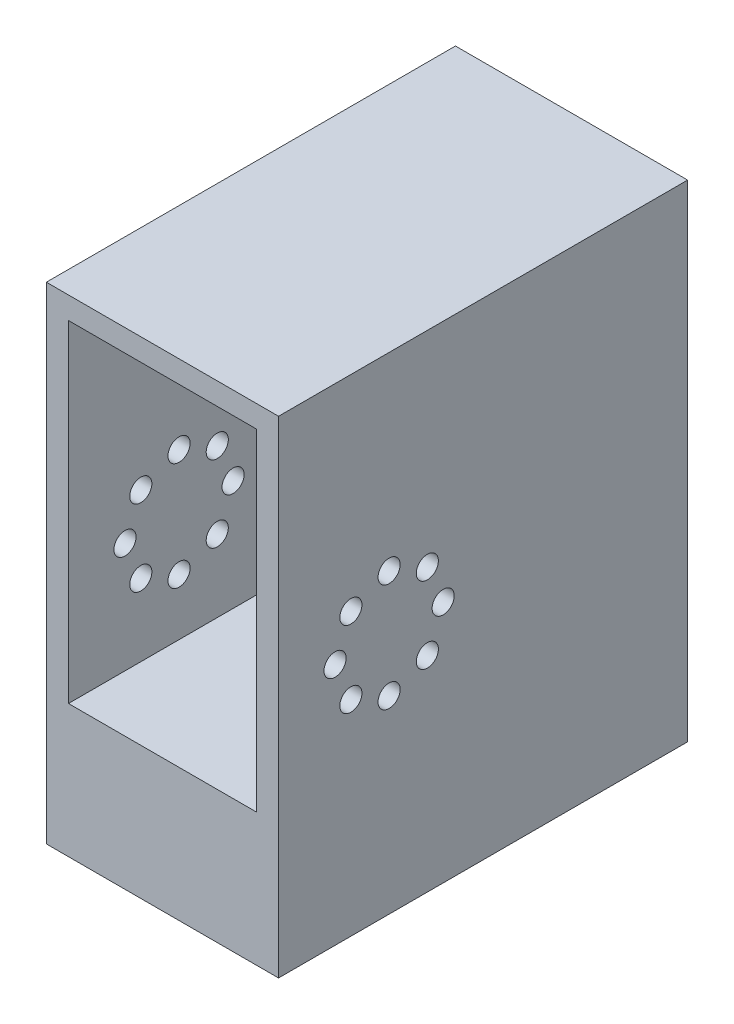
ISO-10303-21;
HEADER;
FILE_DESCRIPTION(('STEP AP214'),'2;1');
FILE_NAME('part.step','',(''),(''),'','','');
FILE_SCHEMA(('AUTOMOTIVE_DESIGN { 1 0 10303 214 1 1 1 1 }'));
ENDSEC;
DATA;
#1=APPLICATION_CONTEXT('core data for automotive mechanical design processes');
#2=APPLICATION_PROTOCOL_DEFINITION('international standard','automotive_design',2000,#1);
#3=PRODUCT_CONTEXT('',#1,'mechanical');
#4=PRODUCT('Part','Part','',(#3));
#5=PRODUCT_RELATED_PRODUCT_CATEGORY('part','',(#4));
#6=PRODUCT_DEFINITION_FORMATION('','',#4);
#7=PRODUCT_DEFINITION_CONTEXT('part definition',#1,'design');
#8=PRODUCT_DEFINITION('design','',#6,#7);
#9=PRODUCT_DEFINITION_SHAPE('','',#8);
#10=(LENGTH_UNIT() NAMED_UNIT(*) SI_UNIT(.MILLI.,.METRE.));
#11=(NAMED_UNIT(*) PLANE_ANGLE_UNIT() SI_UNIT($,.RADIAN.));
#12=(NAMED_UNIT(*) SI_UNIT($,.STERADIAN.) SOLID_ANGLE_UNIT());
#13=UNCERTAINTY_MEASURE_WITH_UNIT(LENGTH_MEASURE(1.E-05),#10,'distance_accuracy_value','');
#14=(GEOMETRIC_REPRESENTATION_CONTEXT(3) GLOBAL_UNCERTAINTY_ASSIGNED_CONTEXT((#13)) GLOBAL_UNIT_ASSIGNED_CONTEXT((#10,
#11,#12)) REPRESENTATION_CONTEXT('',''));
#15=CARTESIAN_POINT('',(0.,0.,0.));
#16=DIRECTION('',(0.,0.,1.));
#17=DIRECTION('',(1.,0.,0.));
#18=AXIS2_PLACEMENT_3D('',#15,#16,#17);
#19=CARTESIAN_POINT('',(0.,0.,60.));
#20=DIRECTION('',(0.,0.,-1.));
#21=DIRECTION('',(-1.,0.,0.));
#22=AXIS2_PLACEMENT_3D('',#19,#20,#21);
#23=PLANE('',#22);
#24=DIRECTION('',(0.,1.,0.));
#25=VECTOR('',#24,1.);
#26=CARTESIAN_POINT('',(21.,-34.,60.));
#27=LINE('',#26,#25);
#28=CARTESIAN_POINT('',(21.,-54.,60.));
#29=VERTEX_POINT('',#28);
#30=CARTESIAN_POINT('',(20.9999999999999,34.0000000000001,59.9999999999999));
#31=VERTEX_POINT('',#30);
#32=EDGE_CURVE('E112',#29,#31,#27,.T.);
#33=ORIENTED_EDGE('',*,*,#32,.T.);
#34=DIRECTION('',(-0.999999999999999,0.,0.));
#35=VECTOR('',#34,1.);
#36=CARTESIAN_POINT('',(-21.,34.0000000000001,59.9999999999999));
#37=LINE('',#36,#35);
#38=CARTESIAN_POINT('',(-21.,34.0000000000001,59.9999999999999));
#39=VERTEX_POINT('',#38);
#40=EDGE_CURVE('E248',#31,#39,#37,.T.);
#41=ORIENTED_EDGE('',*,*,#40,.T.);
#42=DIRECTION('',(0.,-1.,0.));
#43=VECTOR('',#42,1.);
#44=CARTESIAN_POINT('',(-21.,-34.0000000000001,60.));
#45=LINE('',#44,#43);
#46=CARTESIAN_POINT('',(-21.,-54.,60.));
#47=VERTEX_POINT('',#46);
#48=EDGE_CURVE('E250',#39,#47,#45,.T.);
#49=ORIENTED_EDGE('',*,*,#48,.T.);
#50=DIRECTION('',(0.999999999999999,0.,0.));
#51=VECTOR('',#50,1.);
#52=CARTESIAN_POINT('',(-88.0522184569608,-54.,60.));
#53=LINE('',#52,#51);
#54=EDGE_CURVE('E116',#47,#29,#53,.T.);
#55=ORIENTED_EDGE('',*,*,#54,.T.);
#56=EDGE_LOOP('',(#33,#41,#49,#55));
#57=FACE_BOUND('',#56,.T.);
#58=DIRECTION('',(0.,1.,0.));
#59=VECTOR('',#58,1.);
#60=CARTESIAN_POINT('',(17.,-30.,60.0000000000001));
#61=LINE('',#60,#59);
#62=CARTESIAN_POINT('',(17.,-30.,60.0000000000001));
#63=VERTEX_POINT('',#62);
#64=CARTESIAN_POINT('',(16.9999999999999,30.0000000000001,60.0000000000002));
#65=VERTEX_POINT('',#64);
#66=EDGE_CURVE('E222',#63,#65,#61,.T.);
#67=ORIENTED_EDGE('',*,*,#66,.F.);
#68=DIRECTION('',(1.,0.,0.));
#69=VECTOR('',#68,1.);
#70=CARTESIAN_POINT('',(-17.0000000000002,-30.0000000000001,60.));
#71=LINE('',#70,#69);
#72=CARTESIAN_POINT('',(-17.0000000000002,-30.0000000000001,60.));
#73=VERTEX_POINT('',#72);
#74=EDGE_CURVE('E229',#73,#63,#71,.T.);
#75=ORIENTED_EDGE('',*,*,#74,.F.);
#76=DIRECTION('',(0.,-1.,0.));
#77=VECTOR('',#76,1.);
#78=CARTESIAN_POINT('',(-17.0000000000002,-30.0000000000001,60.));
#79=LINE('',#78,#77);
#80=CARTESIAN_POINT('',(-17.0000000000001,30.,60.0000000000003));
#81=VERTEX_POINT('',#80);
#82=EDGE_CURVE('E227',#81,#73,#79,.T.);
#83=ORIENTED_EDGE('',*,*,#82,.F.);
#84=DIRECTION('',(-1.,0.,0.));
#85=VECTOR('',#84,1.);
#86=CARTESIAN_POINT('',(-17.0000000000001,30.,60.0000000000003));
#87=LINE('',#86,#85);
#88=EDGE_CURVE('E224',#65,#81,#87,.T.);
#89=ORIENTED_EDGE('',*,*,#88,.F.);
#90=EDGE_LOOP('',(#67,#75,#83,#89));
#91=FACE_BOUND('',#90,.T.);
#92=ADVANCED_FACE('F38',(#57,#91),#23,.F.);
#93=CARTESIAN_POINT('',(21.,-34.,60.));
#94=DIRECTION('',(-1.,0.,0.));
#95=DIRECTION('',(0.,0.,1.));
#96=AXIS2_PLACEMENT_3D('',#93,#94,#95);
#97=PLANE('',#96);
#98=CARTESIAN_POINT('',(20.9999999999999,-16.9147972132232,46.9147972132232));
#99=DIRECTION('',(1.,0.,0.));
#100=DIRECTION('',(0.,0.,-1.));
#101=AXIS2_PLACEMENT_3D('',#98,#99,#100);
#102=CIRCLE('',#101,2.);
#103=CARTESIAN_POINT('',(20.9999999999999,-16.9147972132232,44.9147972132232));
#104=VERTEX_POINT('',#103);
#105=EDGE_CURVE('E143',#104,#104,#102,.T.);
#106=ORIENTED_EDGE('',*,*,#105,.F.);
#107=EDGE_LOOP('',(#106));
#108=FACE_BOUND('',#107,.T.);
#109=CARTESIAN_POINT('',(20.9999999999999,-19.779,40.));
#110=DIRECTION('',(1.,0.,0.));
#111=DIRECTION('',(0.,0.,-1.));
#112=AXIS2_PLACEMENT_3D('',#109,#110,#111);
#113=CIRCLE('',#112,2.);
#114=CARTESIAN_POINT('',(20.9999999999999,-19.779,38.));
#115=VERTEX_POINT('',#114);
#116=EDGE_CURVE('E176',#115,#115,#113,.T.);
#117=ORIENTED_EDGE('',*,*,#116,.F.);
#118=EDGE_LOOP('',(#117));
#119=FACE_BOUND('',#118,.T.);
#120=CARTESIAN_POINT('',(20.9999999999999,-16.9147972132233,33.0852027867768));
#121=DIRECTION('',(1.,0.,0.));
#122=DIRECTION('',(0.,0.,-1.));
#123=AXIS2_PLACEMENT_3D('',#120,#121,#122);
#124=CIRCLE('',#123,2.);
#125=CARTESIAN_POINT('',(20.9999999999999,-16.9147972132233,31.0852027867768));
#126=VERTEX_POINT('',#125);
#127=EDGE_CURVE('E170',#126,#126,#124,.T.);
#128=ORIENTED_EDGE('',*,*,#127,.F.);
#129=EDGE_LOOP('',(#128));
#130=FACE_BOUND('',#129,.T.);
#131=CARTESIAN_POINT('',(21.,-10.,30.2210000000001));
#132=DIRECTION('',(1.,0.,0.));
#133=DIRECTION('',(0.,0.,-1.));
#134=AXIS2_PLACEMENT_3D('',#131,#132,#133);
#135=CIRCLE('',#134,2.);
#136=CARTESIAN_POINT('',(21.,-10.,28.2210000000001));
#137=VERTEX_POINT('',#136);
#138=EDGE_CURVE('E164',#137,#137,#135,.T.);
#139=ORIENTED_EDGE('',*,*,#138,.F.);
#140=EDGE_LOOP('',(#139));
#141=FACE_BOUND('',#140,.T.);
#142=CARTESIAN_POINT('',(21.,-3.08520278677676,33.0852027867767));
#143=DIRECTION('',(1.,0.,0.));
#144=DIRECTION('',(0.,0.,-1.));
#145=AXIS2_PLACEMENT_3D('',#142,#143,#144);
#146=CIRCLE('',#145,2.);
#147=CARTESIAN_POINT('',(21.,-3.08520278677676,31.0852027867767));
#148=VERTEX_POINT('',#147);
#149=EDGE_CURVE('E158',#148,#148,#146,.T.);
#150=ORIENTED_EDGE('',*,*,#149,.F.);
#151=EDGE_LOOP('',(#150));
#152=FACE_BOUND('',#151,.T.);
#153=CARTESIAN_POINT('',(21.,-0.221000000000054,40.));
#154=DIRECTION('',(1.,0.,0.));
#155=DIRECTION('',(0.,0.,-1.));
#156=AXIS2_PLACEMENT_3D('',#153,#154,#155);
#157=CIRCLE('',#156,2.);
#158=CARTESIAN_POINT('',(21.,-0.221000000000054,38.));
#159=VERTEX_POINT('',#158);
#160=EDGE_CURVE('E152',#159,#159,#157,.T.);
#161=ORIENTED_EDGE('',*,*,#160,.F.);
#162=EDGE_LOOP('',(#161));
#163=FACE_BOUND('',#162,.T.);
#164=CARTESIAN_POINT('',(21.,-3.08520278677674,46.9147972132232));
#165=DIRECTION('',(1.,0.,0.));
#166=DIRECTION('',(0.,0.,-1.));
#167=AXIS2_PLACEMENT_3D('',#164,#165,#166);
#168=CIRCLE('',#167,2.);
#169=CARTESIAN_POINT('',(21.,-3.08520278677674,44.9147972132232));
#170=VERTEX_POINT('',#169);
#171=EDGE_CURVE('E144',#170,#170,#168,.T.);
#172=ORIENTED_EDGE('',*,*,#171,.F.);
#173=EDGE_LOOP('',(#172));
#174=FACE_BOUND('',#173,.T.);
#175=CARTESIAN_POINT('',(21.,-10.,49.7790000000001));
#176=DIRECTION('',(1.,0.,0.));
#177=DIRECTION('',(0.,0.,-1.));
#178=AXIS2_PLACEMENT_3D('',#175,#176,#177);
#179=CIRCLE('',#178,2.);
#180=CARTESIAN_POINT('',(21.,-10.,47.7790000000001));
#181=VERTEX_POINT('',#180);
#182=EDGE_CURVE('E151',#181,#181,#179,.T.);
#183=ORIENTED_EDGE('',*,*,#182,.F.);
#184=EDGE_LOOP('',(#183));
#185=FACE_BOUND('',#184,.T.);
#186=ORIENTED_EDGE('',*,*,#32,.F.);
#187=DIRECTION('',(0.,0.,1.));
#188=VECTOR('',#187,1.);
#189=CARTESIAN_POINT('',(21.,-53.9999999999999,0.));
#190=LINE('',#189,#188);
#191=CARTESIAN_POINT('',(20.9999999999999,-53.9999999999999,-14.0000000000001));
#192=VERTEX_POINT('',#191);
#193=EDGE_CURVE('E106',#192,#29,#190,.T.);
#194=ORIENTED_EDGE('',*,*,#193,.F.);
#195=DIRECTION('',(0.,-1.,0.));
#196=VECTOR('',#195,1.);
#197=CARTESIAN_POINT('',(21.,34.,-14.0000000000001));
#198=LINE('',#197,#196);
#199=CARTESIAN_POINT('',(21.,34.,-14.0000000000001));
#200=VERTEX_POINT('',#199);
#201=EDGE_CURVE('E110',#200,#192,#198,.T.);
#202=ORIENTED_EDGE('',*,*,#201,.F.);
#203=DIRECTION('',(0.,0.,-1.));
#204=VECTOR('',#203,1.);
#205=CARTESIAN_POINT('',(20.9999999999999,34.0000000000001,59.9999999999999));
#206=LINE('',#205,#204);
#207=EDGE_CURVE('E11',#31,#200,#206,.T.);
#208=ORIENTED_EDGE('',*,*,#207,.F.);
#209=EDGE_LOOP('',(#186,#194,#202,#208));
#210=FACE_BOUND('',#209,.T.);
#211=ADVANCED_FACE('F40',(#108,#119,#130,#141,#152,#163,#174,#185,#210),#97,.F.);
#212=CARTESIAN_POINT('',(-21.,34.0000000000001,59.9999999999999));
#213=DIRECTION('',(0.,-1.,0.));
#214=DIRECTION('',(0.,0.,-1.));
#215=AXIS2_PLACEMENT_3D('',#212,#213,#214);
#216=PLANE('',#215);
#217=ORIENTED_EDGE('',*,*,#207,.T.);
#218=DIRECTION('',(1.,0.,0.));
#219=VECTOR('',#218,1.);
#220=CARTESIAN_POINT('',(21.,34.,-14.0000000000001));
#221=LINE('',#220,#219);
#222=CARTESIAN_POINT('',(-21.,34.,-14.));
#223=VERTEX_POINT('',#222);
#224=EDGE_CURVE('E117',#223,#200,#221,.T.);
#225=ORIENTED_EDGE('',*,*,#224,.F.);
#226=DIRECTION('',(0.,0.,-1.));
#227=VECTOR('',#226,1.);
#228=CARTESIAN_POINT('',(-21.,34.0000000000001,59.9999999999999));
#229=LINE('',#228,#227);
#230=EDGE_CURVE('E47',#39,#223,#229,.T.);
#231=ORIENTED_EDGE('',*,*,#230,.F.);
#232=ORIENTED_EDGE('',*,*,#40,.F.);
#233=EDGE_LOOP('',(#217,#225,#231,#232));
#234=FACE_BOUND('',#233,.T.);
#235=ADVANCED_FACE('F317',(#234),#216,.F.);
#236=CARTESIAN_POINT('',(-21.,-34.0000000000001,60.));
#237=DIRECTION('',(1.,0.,0.));
#238=DIRECTION('',(0.,0.,-1.));
#239=AXIS2_PLACEMENT_3D('',#236,#237,#238);
#240=PLANE('',#239);
#241=CARTESIAN_POINT('',(-21.,-16.9147972132232,46.9147972132233));
#242=DIRECTION('',(1.,0.,0.));
#243=DIRECTION('',(0.,0.,-1.));
#244=AXIS2_PLACEMENT_3D('',#241,#242,#243);
#245=CIRCLE('',#244,2.);
#246=CARTESIAN_POINT('',(-21.,-16.9147972132232,44.9147972132233));
#247=VERTEX_POINT('',#246);
#248=EDGE_CURVE('E179',#247,#247,#245,.T.);
#249=ORIENTED_EDGE('',*,*,#248,.T.);
#250=EDGE_LOOP('',(#249));
#251=FACE_BOUND('',#250,.T.);
#252=CARTESIAN_POINT('',(-21.0000000000002,-19.779,40.));
#253=DIRECTION('',(1.,0.,0.));
#254=DIRECTION('',(0.,0.,-1.));
#255=AXIS2_PLACEMENT_3D('',#252,#253,#254);
#256=CIRCLE('',#255,2.);
#257=CARTESIAN_POINT('',(-21.0000000000002,-19.779,38.));
#258=VERTEX_POINT('',#257);
#259=EDGE_CURVE('E173',#258,#258,#256,.T.);
#260=ORIENTED_EDGE('',*,*,#259,.T.);
#261=EDGE_LOOP('',(#260));
#262=FACE_BOUND('',#261,.T.);
#263=CARTESIAN_POINT('',(-21.,-16.9147972132232,33.0852027867767));
#264=DIRECTION('',(1.,0.,0.));
#265=DIRECTION('',(0.,0.,-1.));
#266=AXIS2_PLACEMENT_3D('',#263,#264,#265);
#267=CIRCLE('',#266,2.);
#268=CARTESIAN_POINT('',(-21.,-16.9147972132232,31.0852027867767));
#269=VERTEX_POINT('',#268);
#270=EDGE_CURVE('E167',#269,#269,#267,.T.);
#271=ORIENTED_EDGE('',*,*,#270,.T.);
#272=EDGE_LOOP('',(#271));
#273=FACE_BOUND('',#272,.T.);
#274=CARTESIAN_POINT('',(-21.,-10.0000000000001,30.2210000000001));
#275=DIRECTION('',(1.,0.,0.));
#276=DIRECTION('',(0.,0.,-1.));
#277=AXIS2_PLACEMENT_3D('',#274,#275,#276);
#278=CIRCLE('',#277,2.);
#279=CARTESIAN_POINT('',(-21.,-10.0000000000001,28.221));
#280=VERTEX_POINT('',#279);
#281=EDGE_CURVE('E161',#280,#280,#278,.T.);
#282=ORIENTED_EDGE('',*,*,#281,.T.);
#283=EDGE_LOOP('',(#282));
#284=FACE_BOUND('',#283,.T.);
#285=CARTESIAN_POINT('',(-21.,-3.08520278677678,33.0852027867767));
#286=DIRECTION('',(1.,0.,0.));
#287=DIRECTION('',(0.,0.,-1.));
#288=AXIS2_PLACEMENT_3D('',#285,#286,#287);
#289=CIRCLE('',#288,2.);
#290=CARTESIAN_POINT('',(-21.,-3.08520278677678,31.0852027867767));
#291=VERTEX_POINT('',#290);
#292=EDGE_CURVE('E155',#291,#291,#289,.T.);
#293=ORIENTED_EDGE('',*,*,#292,.T.);
#294=EDGE_LOOP('',(#293));
#295=FACE_BOUND('',#294,.T.);
#296=CARTESIAN_POINT('',(-21.,-0.221000000000054,40.));
#297=DIRECTION('',(1.,0.,0.));
#298=DIRECTION('',(0.,0.,-1.));
#299=AXIS2_PLACEMENT_3D('',#296,#297,#298);
#300=CIRCLE('',#299,2.);
#301=CARTESIAN_POINT('',(-21.,-0.221000000000054,38.));
#302=VERTEX_POINT('',#301);
#303=EDGE_CURVE('E148',#302,#302,#300,.T.);
#304=ORIENTED_EDGE('',*,*,#303,.T.);
#305=EDGE_LOOP('',(#304));
#306=FACE_BOUND('',#305,.T.);
#307=CARTESIAN_POINT('',(-21.0000000000001,-3.08520278677665,46.9147972132231));
#308=DIRECTION('',(1.,0.,0.));
#309=DIRECTION('',(0.,0.,-1.));
#310=AXIS2_PLACEMENT_3D('',#307,#308,#309);
#311=CIRCLE('',#310,2.);
#312=CARTESIAN_POINT('',(-21.0000000000001,-3.08520278677665,44.9147972132231));
#313=VERTEX_POINT('',#312);
#314=EDGE_CURVE('E147',#313,#313,#311,.T.);
#315=ORIENTED_EDGE('',*,*,#314,.T.);
#316=EDGE_LOOP('',(#315));
#317=FACE_BOUND('',#316,.T.);
#318=CARTESIAN_POINT('',(-21.0000000000001,-10.,49.779));
#319=DIRECTION('',(1.,0.,0.));
#320=DIRECTION('',(0.,0.,-1.));
#321=AXIS2_PLACEMENT_3D('',#318,#319,#320);
#322=CIRCLE('',#321,2.);
#323=CARTESIAN_POINT('',(-21.0000000000001,-10.,47.779));
#324=VERTEX_POINT('',#323);
#325=EDGE_CURVE('E188',#324,#324,#322,.T.);
#326=ORIENTED_EDGE('',*,*,#325,.T.);
#327=EDGE_LOOP('',(#326));
#328=FACE_BOUND('',#327,.T.);
#329=ORIENTED_EDGE('',*,*,#230,.T.);
#330=DIRECTION('',(0.,1.,0.));
#331=VECTOR('',#330,1.);
#332=CARTESIAN_POINT('',(-21.,34.,-14.));
#333=LINE('',#332,#331);
#334=CARTESIAN_POINT('',(-21.0000000000001,-53.9999999999999,-14.));
#335=VERTEX_POINT('',#334);
#336=EDGE_CURVE('E127',#335,#223,#333,.T.);
#337=ORIENTED_EDGE('',*,*,#336,.F.);
#338=DIRECTION('',(0.,0.,-1.));
#339=VECTOR('',#338,1.);
#340=CARTESIAN_POINT('',(-21.,-53.9999999999999,0.));
#341=LINE('',#340,#339);
#342=EDGE_CURVE('E123',#47,#335,#341,.T.);
#343=ORIENTED_EDGE('',*,*,#342,.F.);
#344=ORIENTED_EDGE('',*,*,#48,.F.);
#345=EDGE_LOOP('',(#329,#337,#343,#344));
#346=FACE_BOUND('',#345,.T.);
#347=ADVANCED_FACE('F322',(#251,#262,#273,#284,#295,#306,#317,#328,#346),#240,.F.);
#348=CARTESIAN_POINT('',(17.,-30.,60.0000000000001));
#349=DIRECTION('',(-1.,0.,0.));
#350=DIRECTION('',(0.,0.,1.));
#351=AXIS2_PLACEMENT_3D('',#348,#349,#350);
#352=PLANE('',#351);
#353=CARTESIAN_POINT('',(16.9999999999999,-16.9147972132232,46.9147972132232));
#354=DIRECTION('',(-1.,0.,0.));
#355=DIRECTION('',(0.,0.,1.));
#356=AXIS2_PLACEMENT_3D('',#353,#354,#355);
#357=CIRCLE('',#356,2.);
#358=CARTESIAN_POINT('',(16.9999999999999,-16.9147972132232,48.9147972132232));
#359=VERTEX_POINT('',#358);
#360=EDGE_CURVE('E219',#359,#359,#357,.T.);
#361=ORIENTED_EDGE('',*,*,#360,.F.);
#362=EDGE_LOOP('',(#361));
#363=FACE_BOUND('',#362,.T.);
#364=CARTESIAN_POINT('',(17.,-19.779,40.));
#365=DIRECTION('',(-1.,0.,0.));
#366=DIRECTION('',(0.,0.,1.));
#367=AXIS2_PLACEMENT_3D('',#364,#365,#366);
#368=CIRCLE('',#367,2.);
#369=CARTESIAN_POINT('',(17.,-19.779,42.));
#370=VERTEX_POINT('',#369);
#371=EDGE_CURVE('E216',#370,#370,#368,.T.);
#372=ORIENTED_EDGE('',*,*,#371,.F.);
#373=EDGE_LOOP('',(#372));
#374=FACE_BOUND('',#373,.T.);
#375=CARTESIAN_POINT('',(17.,-16.9147972132232,33.0852027867768));
#376=DIRECTION('',(-1.,0.,0.));
#377=DIRECTION('',(0.,0.,1.));
#378=AXIS2_PLACEMENT_3D('',#375,#376,#377);
#379=CIRCLE('',#378,2.);
#380=CARTESIAN_POINT('',(17.,-16.9147972132232,35.0852027867768));
#381=VERTEX_POINT('',#380);
#382=EDGE_CURVE('E212',#381,#381,#379,.T.);
#383=ORIENTED_EDGE('',*,*,#382,.F.);
#384=EDGE_LOOP('',(#383));
#385=FACE_BOUND('',#384,.T.);
#386=CARTESIAN_POINT('',(16.9999999999999,-10.0000000000001,30.221));
#387=DIRECTION('',(-1.,0.,0.));
#388=DIRECTION('',(0.,0.,1.));
#389=AXIS2_PLACEMENT_3D('',#386,#387,#388);
#390=CIRCLE('',#389,2.);
#391=CARTESIAN_POINT('',(16.9999999999999,-10.0000000000001,32.221));
#392=VERTEX_POINT('',#391);
#393=EDGE_CURVE('E208',#392,#392,#390,.T.);
#394=ORIENTED_EDGE('',*,*,#393,.F.);
#395=EDGE_LOOP('',(#394));
#396=FACE_BOUND('',#395,.T.);
#397=CARTESIAN_POINT('',(17.,-3.08520278677679,33.0852027867767));
#398=DIRECTION('',(-1.,0.,0.));
#399=DIRECTION('',(0.,0.,1.));
#400=AXIS2_PLACEMENT_3D('',#397,#398,#399);
#401=CIRCLE('',#400,2.);
#402=CARTESIAN_POINT('',(17.,-3.08520278677679,35.0852027867767));
#403=VERTEX_POINT('',#402);
#404=EDGE_CURVE('E204',#403,#403,#401,.T.);
#405=ORIENTED_EDGE('',*,*,#404,.F.);
#406=EDGE_LOOP('',(#405));
#407=FACE_BOUND('',#406,.T.);
#408=CARTESIAN_POINT('',(17.,-0.221000000000041,39.9999999999999));
#409=DIRECTION('',(-1.,0.,0.));
#410=DIRECTION('',(0.,0.,1.));
#411=AXIS2_PLACEMENT_3D('',#408,#409,#410);
#412=CIRCLE('',#411,2.);
#413=CARTESIAN_POINT('',(17.,-0.221000000000041,41.9999999999999));
#414=VERTEX_POINT('',#413);
#415=EDGE_CURVE('E200',#414,#414,#412,.T.);
#416=ORIENTED_EDGE('',*,*,#415,.F.);
#417=EDGE_LOOP('',(#416));
#418=FACE_BOUND('',#417,.T.);
#419=CARTESIAN_POINT('',(17.,-3.08520278677674,46.9147972132232));
#420=DIRECTION('',(-1.,0.,0.));
#421=DIRECTION('',(0.,0.,1.));
#422=AXIS2_PLACEMENT_3D('',#419,#420,#421);
#423=CIRCLE('',#422,2.);
#424=CARTESIAN_POINT('',(17.,-3.08520278677674,48.9147972132232));
#425=VERTEX_POINT('',#424);
#426=EDGE_CURVE('E196',#425,#425,#423,.T.);
#427=ORIENTED_EDGE('',*,*,#426,.F.);
#428=EDGE_LOOP('',(#427));
#429=FACE_BOUND('',#428,.T.);
#430=CARTESIAN_POINT('',(17.,-10.,49.7790000000001));
#431=DIRECTION('',(-1.,0.,0.));
#432=DIRECTION('',(0.,0.,1.));
#433=AXIS2_PLACEMENT_3D('',#430,#431,#432);
#434=CIRCLE('',#433,2.);
#435=CARTESIAN_POINT('',(17.,-10.,51.7790000000001));
#436=VERTEX_POINT('',#435);
#437=EDGE_CURVE('E192',#436,#436,#434,.T.);
#438=ORIENTED_EDGE('',*,*,#437,.F.);
#439=EDGE_LOOP('',(#438));
#440=FACE_BOUND('',#439,.T.);
#441=DIRECTION('',(0.,1.,0.));
#442=VECTOR('',#441,1.);
#443=CARTESIAN_POINT('',(16.9999999999999,-30.,0.));
#444=LINE('',#443,#442);
#445=CARTESIAN_POINT('',(16.9999999999999,-30.,0.));
#446=VERTEX_POINT('',#445);
#447=CARTESIAN_POINT('',(17.,30.,2.22044604925031E-13));
#448=VERTEX_POINT('',#447);
#449=EDGE_CURVE('E63',#446,#448,#444,.T.);
#450=ORIENTED_EDGE('',*,*,#449,.F.);
#451=DIRECTION('',(0.,0.,-1.));
#452=VECTOR('',#451,1.);
#453=CARTESIAN_POINT('',(17.,-30.,60.0000000000001));
#454=LINE('',#453,#452);
#455=EDGE_CURVE('E231',#63,#446,#454,.T.);
#456=ORIENTED_EDGE('',*,*,#455,.F.);
#457=ORIENTED_EDGE('',*,*,#66,.T.);
#458=DIRECTION('',(0.,0.,-1.));
#459=VECTOR('',#458,1.);
#460=CARTESIAN_POINT('',(16.9999999999999,30.0000000000001,60.0000000000002));
#461=LINE('',#460,#459);
#462=EDGE_CURVE('E245',#65,#448,#461,.T.);
#463=ORIENTED_EDGE('',*,*,#462,.T.);
#464=EDGE_LOOP('',(#450,#456,#457,#463));
#465=FACE_BOUND('',#464,.T.);
#466=ADVANCED_FACE('F297',(#363,#374,#385,#396,#407,#418,#429,#440,#465),#352,.T.);
#467=CARTESIAN_POINT('',(-17.0000000000001,30.,60.0000000000003));
#468=DIRECTION('',(0.,-1.,0.));
#469=DIRECTION('',(0.,0.,-1.));
#470=AXIS2_PLACEMENT_3D('',#467,#468,#469);
#471=PLANE('',#470);
#472=DIRECTION('',(-1.,0.,0.));
#473=VECTOR('',#472,1.);
#474=CARTESIAN_POINT('',(-17.,30.0000000000001,1.66533453693773E-13));
#475=LINE('',#474,#473);
#476=CARTESIAN_POINT('',(-17.,30.0000000000001,1.66533453693773E-13));
#477=VERTEX_POINT('',#476);
#478=EDGE_CURVE('E233',#448,#477,#475,.T.);
#479=ORIENTED_EDGE('',*,*,#478,.F.);
#480=ORIENTED_EDGE('',*,*,#462,.F.);
#481=ORIENTED_EDGE('',*,*,#88,.T.);
#482=DIRECTION('',(0.,0.,-1.));
#483=VECTOR('',#482,1.);
#484=CARTESIAN_POINT('',(-17.0000000000001,30.,60.0000000000003));
#485=LINE('',#484,#483);
#486=EDGE_CURVE('E243',#81,#477,#485,.T.);
#487=ORIENTED_EDGE('',*,*,#486,.T.);
#488=EDGE_LOOP('',(#479,#480,#481,#487));
#489=FACE_BOUND('',#488,.T.);
#490=ADVANCED_FACE('F274',(#489),#471,.T.);
#491=CARTESIAN_POINT('',(-17.0000000000002,-30.0000000000001,60.));
#492=DIRECTION('',(1.,0.,0.));
#493=DIRECTION('',(0.,0.,-1.));
#494=AXIS2_PLACEMENT_3D('',#491,#492,#493);
#495=PLANE('',#494);
#496=CARTESIAN_POINT('',(-17.,-16.9147972132232,46.9147972132233));
#497=DIRECTION('',(1.,0.,0.));
#498=DIRECTION('',(0.,0.,-1.));
#499=AXIS2_PLACEMENT_3D('',#496,#497,#498);
#500=CIRCLE('',#499,2.);
#501=CARTESIAN_POINT('',(-17.,-16.9147972132232,44.9147972132233));
#502=VERTEX_POINT('',#501);
#503=EDGE_CURVE('E42',#502,#502,#500,.T.);
#504=ORIENTED_EDGE('',*,*,#503,.F.);
#505=EDGE_LOOP('',(#504));
#506=FACE_BOUND('',#505,.T.);
#507=CARTESIAN_POINT('',(-17.,-19.779,40.));
#508=DIRECTION('',(1.,0.,0.));
#509=DIRECTION('',(0.,0.,-1.));
#510=AXIS2_PLACEMENT_3D('',#507,#508,#509);
#511=CIRCLE('',#510,2.);
#512=CARTESIAN_POINT('',(-17.,-19.779,38.));
#513=VERTEX_POINT('',#512);
#514=EDGE_CURVE('E215',#513,#513,#511,.T.);
#515=ORIENTED_EDGE('',*,*,#514,.F.);
#516=EDGE_LOOP('',(#515));
#517=FACE_BOUND('',#516,.T.);
#518=CARTESIAN_POINT('',(-17.,-16.9147972132233,33.0852027867768));
#519=DIRECTION('',(1.,0.,0.));
#520=DIRECTION('',(0.,0.,-1.));
#521=AXIS2_PLACEMENT_3D('',#518,#519,#520);
#522=CIRCLE('',#521,2.);
#523=CARTESIAN_POINT('',(-17.,-16.9147972132233,31.0852027867768));
#524=VERTEX_POINT('',#523);
#525=EDGE_CURVE('E211',#524,#524,#522,.T.);
#526=ORIENTED_EDGE('',*,*,#525,.F.);
#527=EDGE_LOOP('',(#526));
#528=FACE_BOUND('',#527,.T.);
#529=CARTESIAN_POINT('',(-17.,-10.0000000000001,30.2210000000001));
#530=DIRECTION('',(1.,0.,0.));
#531=DIRECTION('',(0.,0.,-1.));
#532=AXIS2_PLACEMENT_3D('',#529,#530,#531);
#533=CIRCLE('',#532,2.);
#534=CARTESIAN_POINT('',(-17.,-10.0000000000001,28.221));
#535=VERTEX_POINT('',#534);
#536=EDGE_CURVE('E207',#535,#535,#533,.T.);
#537=ORIENTED_EDGE('',*,*,#536,.F.);
#538=EDGE_LOOP('',(#537));
#539=FACE_BOUND('',#538,.T.);
#540=CARTESIAN_POINT('',(-17.,-3.08520278677679,33.0852027867767));
#541=DIRECTION('',(1.,0.,0.));
#542=DIRECTION('',(0.,0.,-1.));
#543=AXIS2_PLACEMENT_3D('',#540,#541,#542);
#544=CIRCLE('',#543,2.);
#545=CARTESIAN_POINT('',(-17.,-3.08520278677679,31.0852027867767));
#546=VERTEX_POINT('',#545);
#547=EDGE_CURVE('E203',#546,#546,#544,.T.);
#548=ORIENTED_EDGE('',*,*,#547,.F.);
#549=EDGE_LOOP('',(#548));
#550=FACE_BOUND('',#549,.T.);
#551=CARTESIAN_POINT('',(-17.0000000000001,-0.221000000000068,39.9999999999999));
#552=DIRECTION('',(1.,0.,0.));
#553=DIRECTION('',(0.,0.,-1.));
#554=AXIS2_PLACEMENT_3D('',#551,#552,#553);
#555=CIRCLE('',#554,2.);
#556=CARTESIAN_POINT('',(-17.0000000000001,-0.221000000000067,37.9999999999999));
#557=VERTEX_POINT('',#556);
#558=EDGE_CURVE('E199',#557,#557,#555,.T.);
#559=ORIENTED_EDGE('',*,*,#558,.F.);
#560=EDGE_LOOP('',(#559));
#561=FACE_BOUND('',#560,.T.);
#562=CARTESIAN_POINT('',(-17.,-3.08520278677674,46.9147972132232));
#563=DIRECTION('',(1.,0.,0.));
#564=DIRECTION('',(0.,0.,-1.));
#565=AXIS2_PLACEMENT_3D('',#562,#563,#564);
#566=CIRCLE('',#565,2.);
#567=CARTESIAN_POINT('',(-17.,-3.08520278677674,44.9147972132232));
#568=VERTEX_POINT('',#567);
#569=EDGE_CURVE('E195',#568,#568,#566,.T.);
#570=ORIENTED_EDGE('',*,*,#569,.F.);
#571=EDGE_LOOP('',(#570));
#572=FACE_BOUND('',#571,.T.);
#573=CARTESIAN_POINT('',(-17.0000000000001,-10.,49.779));
#574=DIRECTION('',(1.,0.,0.));
#575=DIRECTION('',(0.,0.,-1.));
#576=AXIS2_PLACEMENT_3D('',#573,#574,#575);
#577=CIRCLE('',#576,2.);
#578=CARTESIAN_POINT('',(-17.0000000000001,-10.,47.779));
#579=VERTEX_POINT('',#578);
#580=EDGE_CURVE('E191',#579,#579,#577,.T.);
#581=ORIENTED_EDGE('',*,*,#580,.F.);
#582=EDGE_LOOP('',(#581));
#583=FACE_BOUND('',#582,.T.);
#584=DIRECTION('',(0.,-1.,0.));
#585=VECTOR('',#584,1.);
#586=CARTESIAN_POINT('',(-17.0000000000001,-30.,0.));
#587=LINE('',#586,#585);
#588=CARTESIAN_POINT('',(-17.0000000000001,-30.,0.));
#589=VERTEX_POINT('',#588);
#590=EDGE_CURVE('E236',#477,#589,#587,.T.);
#591=ORIENTED_EDGE('',*,*,#590,.F.);
#592=ORIENTED_EDGE('',*,*,#486,.F.);
#593=ORIENTED_EDGE('',*,*,#82,.T.);
#594=DIRECTION('',(0.,0.,-1.));
#595=VECTOR('',#594,1.);
#596=CARTESIAN_POINT('',(-17.0000000000002,-30.0000000000001,60.));
#597=LINE('',#596,#595);
#598=EDGE_CURVE('E55',#73,#589,#597,.T.);
#599=ORIENTED_EDGE('',*,*,#598,.T.);
#600=EDGE_LOOP('',(#591,#592,#593,#599));
#601=FACE_BOUND('',#600,.T.);
#602=ADVANCED_FACE('F270',(#506,#517,#528,#539,#550,#561,#572,#583,#601),#495,.T.);
#603=CARTESIAN_POINT('',(-17.0000000000002,-30.0000000000001,60.));
#604=DIRECTION('',(0.,1.,0.));
#605=DIRECTION('',(0.,0.,1.));
#606=AXIS2_PLACEMENT_3D('',#603,#604,#605);
#607=PLANE('',#606);
#608=DIRECTION('',(1.,0.,0.));
#609=VECTOR('',#608,1.);
#610=CARTESIAN_POINT('',(-17.0000000000001,-30.,0.));
#611=LINE('',#610,#609);
#612=EDGE_CURVE('E225',#589,#446,#611,.T.);
#613=ORIENTED_EDGE('',*,*,#612,.F.);
#614=ORIENTED_EDGE('',*,*,#598,.F.);
#615=ORIENTED_EDGE('',*,*,#74,.T.);
#616=ORIENTED_EDGE('',*,*,#455,.T.);
#617=EDGE_LOOP('',(#613,#614,#615,#616));
#618=FACE_BOUND('',#617,.T.);
#619=ADVANCED_FACE('F273',(#618),#607,.T.);
#620=CARTESIAN_POINT('',(-21.0000000000001,-10.,49.779));
#621=DIRECTION('',(1.,0.,0.));
#622=DIRECTION('',(0.,0.,-1.));
#623=AXIS2_PLACEMENT_3D('',#620,#621,#622);
#624=CYLINDRICAL_SURFACE('',#623,2.);
#625=ORIENTED_EDGE('',*,*,#580,.T.);
#626=EDGE_LOOP('',(#625));
#627=FACE_BOUND('',#626,.T.);
#628=ORIENTED_EDGE('',*,*,#325,.F.);
#629=EDGE_LOOP('',(#628));
#630=FACE_BOUND('',#629,.T.);
#631=ADVANCED_FACE('F302',(#627,#630),#624,.F.);
#632=CARTESIAN_POINT('',(-21.0000000000001,-3.08520278677665,46.9147972132231));
#633=DIRECTION('',(1.,0.,0.));
#634=DIRECTION('',(0.,0.,-1.));
#635=AXIS2_PLACEMENT_3D('',#632,#633,#634);
#636=CYLINDRICAL_SURFACE('',#635,2.);
#637=ORIENTED_EDGE('',*,*,#569,.T.);
#638=EDGE_LOOP('',(#637));
#639=FACE_BOUND('',#638,.T.);
#640=ORIENTED_EDGE('',*,*,#314,.F.);
#641=EDGE_LOOP('',(#640));
#642=FACE_BOUND('',#641,.T.);
#643=ADVANCED_FACE('F307',(#639,#642),#636,.F.);
#644=CARTESIAN_POINT('',(-21.,-0.221000000000054,40.));
#645=DIRECTION('',(1.,0.,0.));
#646=DIRECTION('',(0.,0.,-1.));
#647=AXIS2_PLACEMENT_3D('',#644,#645,#646);
#648=CYLINDRICAL_SURFACE('',#647,2.);
#649=ORIENTED_EDGE('',*,*,#558,.T.);
#650=EDGE_LOOP('',(#649));
#651=FACE_BOUND('',#650,.T.);
#652=ORIENTED_EDGE('',*,*,#303,.F.);
#653=EDGE_LOOP('',(#652));
#654=FACE_BOUND('',#653,.T.);
#655=ADVANCED_FACE('F372',(#651,#654),#648,.F.);
#656=CARTESIAN_POINT('',(-21.,-3.08520278677678,33.0852027867767));
#657=DIRECTION('',(1.,0.,0.));
#658=DIRECTION('',(0.,0.,-1.));
#659=AXIS2_PLACEMENT_3D('',#656,#657,#658);
#660=CYLINDRICAL_SURFACE('',#659,2.);
#661=ORIENTED_EDGE('',*,*,#547,.T.);
#662=EDGE_LOOP('',(#661));
#663=FACE_BOUND('',#662,.T.);
#664=ORIENTED_EDGE('',*,*,#292,.F.);
#665=EDGE_LOOP('',(#664));
#666=FACE_BOUND('',#665,.T.);
#667=ADVANCED_FACE('F383',(#663,#666),#660,.F.);
#668=CARTESIAN_POINT('',(-21.,-10.0000000000001,30.2210000000001));
#669=DIRECTION('',(1.,0.,0.));
#670=DIRECTION('',(0.,0.,-1.));
#671=AXIS2_PLACEMENT_3D('',#668,#669,#670);
#672=CYLINDRICAL_SURFACE('',#671,2.);
#673=ORIENTED_EDGE('',*,*,#536,.T.);
#674=EDGE_LOOP('',(#673));
#675=FACE_BOUND('',#674,.T.);
#676=ORIENTED_EDGE('',*,*,#281,.F.);
#677=EDGE_LOOP('',(#676));
#678=FACE_BOUND('',#677,.T.);
#679=ADVANCED_FACE('F394',(#675,#678),#672,.F.);
#680=CARTESIAN_POINT('',(-21.,-16.9147972132232,33.0852027867767));
#681=DIRECTION('',(1.,0.,0.));
#682=DIRECTION('',(0.,0.,-1.));
#683=AXIS2_PLACEMENT_3D('',#680,#681,#682);
#684=CYLINDRICAL_SURFACE('',#683,2.);
#685=ORIENTED_EDGE('',*,*,#525,.T.);
#686=EDGE_LOOP('',(#685));
#687=FACE_BOUND('',#686,.T.);
#688=ORIENTED_EDGE('',*,*,#270,.F.);
#689=EDGE_LOOP('',(#688));
#690=FACE_BOUND('',#689,.T.);
#691=ADVANCED_FACE('F405',(#687,#690),#684,.F.);
#692=CARTESIAN_POINT('',(-21.0000000000002,-19.779,40.));
#693=DIRECTION('',(1.,0.,0.));
#694=DIRECTION('',(0.,0.,-1.));
#695=AXIS2_PLACEMENT_3D('',#692,#693,#694);
#696=CYLINDRICAL_SURFACE('',#695,2.);
#697=ORIENTED_EDGE('',*,*,#514,.T.);
#698=EDGE_LOOP('',(#697));
#699=FACE_BOUND('',#698,.T.);
#700=ORIENTED_EDGE('',*,*,#259,.F.);
#701=EDGE_LOOP('',(#700));
#702=FACE_BOUND('',#701,.T.);
#703=ADVANCED_FACE('F267',(#699,#702),#696,.F.);
#704=CARTESIAN_POINT('',(-21.,-16.9147972132232,46.9147972132233));
#705=DIRECTION('',(1.,0.,0.));
#706=DIRECTION('',(0.,0.,-1.));
#707=AXIS2_PLACEMENT_3D('',#704,#705,#706);
#708=CYLINDRICAL_SURFACE('',#707,2.);
#709=ORIENTED_EDGE('',*,*,#503,.T.);
#710=EDGE_LOOP('',(#709));
#711=FACE_BOUND('',#710,.T.);
#712=ORIENTED_EDGE('',*,*,#248,.F.);
#713=EDGE_LOOP('',(#712));
#714=FACE_BOUND('',#713,.T.);
#715=ADVANCED_FACE('F426',(#711,#714),#708,.F.);
#716=ORIENTED_EDGE('',*,*,#437,.T.);
#717=EDGE_LOOP('',(#716));
#718=FACE_BOUND('',#717,.T.);
#719=ORIENTED_EDGE('',*,*,#182,.T.);
#720=EDGE_LOOP('',(#719));
#721=FACE_BOUND('',#720,.T.);
#722=ADVANCED_FACE('F310',(#718,#721),#624,.F.);
#723=ORIENTED_EDGE('',*,*,#426,.T.);
#724=EDGE_LOOP('',(#723));
#725=FACE_BOUND('',#724,.T.);
#726=ORIENTED_EDGE('',*,*,#171,.T.);
#727=EDGE_LOOP('',(#726));
#728=FACE_BOUND('',#727,.T.);
#729=ADVANCED_FACE('F375',(#725,#728),#636,.F.);
#730=ORIENTED_EDGE('',*,*,#415,.T.);
#731=EDGE_LOOP('',(#730));
#732=FACE_BOUND('',#731,.T.);
#733=ORIENTED_EDGE('',*,*,#160,.T.);
#734=EDGE_LOOP('',(#733));
#735=FACE_BOUND('',#734,.T.);
#736=ADVANCED_FACE('F386',(#732,#735),#648,.F.);
#737=ORIENTED_EDGE('',*,*,#404,.T.);
#738=EDGE_LOOP('',(#737));
#739=FACE_BOUND('',#738,.T.);
#740=ORIENTED_EDGE('',*,*,#149,.T.);
#741=EDGE_LOOP('',(#740));
#742=FACE_BOUND('',#741,.T.);
#743=ADVANCED_FACE('F397',(#739,#742),#660,.F.);
#744=ORIENTED_EDGE('',*,*,#393,.T.);
#745=EDGE_LOOP('',(#744));
#746=FACE_BOUND('',#745,.T.);
#747=ORIENTED_EDGE('',*,*,#138,.T.);
#748=EDGE_LOOP('',(#747));
#749=FACE_BOUND('',#748,.T.);
#750=ADVANCED_FACE('F408',(#746,#749),#672,.F.);
#751=ORIENTED_EDGE('',*,*,#382,.T.);
#752=EDGE_LOOP('',(#751));
#753=FACE_BOUND('',#752,.T.);
#754=ORIENTED_EDGE('',*,*,#127,.T.);
#755=EDGE_LOOP('',(#754));
#756=FACE_BOUND('',#755,.T.);
#757=ADVANCED_FACE('F418',(#753,#756),#684,.F.);
#758=ORIENTED_EDGE('',*,*,#371,.T.);
#759=EDGE_LOOP('',(#758));
#760=FACE_BOUND('',#759,.T.);
#761=ORIENTED_EDGE('',*,*,#116,.T.);
#762=EDGE_LOOP('',(#761));
#763=FACE_BOUND('',#762,.T.);
#764=ADVANCED_FACE('F428',(#760,#763),#696,.F.);
#765=ORIENTED_EDGE('',*,*,#360,.T.);
#766=EDGE_LOOP('',(#765));
#767=FACE_BOUND('',#766,.T.);
#768=ORIENTED_EDGE('',*,*,#105,.T.);
#769=EDGE_LOOP('',(#768));
#770=FACE_BOUND('',#769,.T.);
#771=ADVANCED_FACE('F438',(#767,#770),#708,.F.);
#772=CARTESIAN_POINT('',(0.,0.,0.));
#773=DIRECTION('',(0.,0.,1.));
#774=DIRECTION('',(1.,0.,0.));
#775=AXIS2_PLACEMENT_3D('',#772,#773,#774);
#776=PLANE('',#775);
#777=ORIENTED_EDGE('',*,*,#590,.T.);
#778=ORIENTED_EDGE('',*,*,#612,.T.);
#779=ORIENTED_EDGE('',*,*,#449,.T.);
#780=ORIENTED_EDGE('',*,*,#478,.T.);
#781=EDGE_LOOP('',(#777,#778,#779,#780));
#782=FACE_BOUND('',#781,.T.);
#783=ADVANCED_FACE('F293',(#782),#776,.T.);
#784=CARTESIAN_POINT('',(-88.0522184569609,-54.,0.));
#785=DIRECTION('',(0.,1.,0.));
#786=DIRECTION('',(0.,0.,1.));
#787=AXIS2_PLACEMENT_3D('',#784,#785,#786);
#788=PLANE('',#787);
#789=ORIENTED_EDGE('',*,*,#54,.F.);
#790=ORIENTED_EDGE('',*,*,#342,.T.);
#791=DIRECTION('',(-1.,0.,0.));
#792=VECTOR('',#791,1.);
#793=CARTESIAN_POINT('',(20.9999999999999,-53.9999999999999,-14.0000000000001));
#794=LINE('',#793,#792);
#795=EDGE_CURVE('E120',#192,#335,#794,.T.);
#796=ORIENTED_EDGE('',*,*,#795,.F.);
#797=ORIENTED_EDGE('',*,*,#193,.T.);
#798=EDGE_LOOP('',(#789,#790,#796,#797));
#799=FACE_BOUND('',#798,.T.);
#800=ADVANCED_FACE('F121',(#799),#788,.F.);
#801=CARTESIAN_POINT('',(0.,0.,-14.));
#802=DIRECTION('',(0.,0.,-1.));
#803=DIRECTION('',(-1.,0.,0.));
#804=AXIS2_PLACEMENT_3D('',#801,#802,#803);
#805=PLANE('',#804);
#806=CARTESIAN_POINT('',(0.,-28.5999999999999,-14.));
#807=DIRECTION('',(0.,0.,-1.));
#808=DIRECTION('',(-1.,0.,0.));
#809=AXIS2_PLACEMENT_3D('',#806,#807,#808);
#810=CIRCLE('',#809,1.2);
#811=CARTESIAN_POINT('',(-1.20000000000008,-28.5999999999999,-14.));
#812=VERTEX_POINT('',#811);
#813=EDGE_CURVE('E658',#812,#812,#810,.T.);
#814=ORIENTED_EDGE('',*,*,#813,.F.);
#815=EDGE_LOOP('',(#814));
#816=FACE_BOUND('',#815,.T.);
#817=CARTESIAN_POINT('',(0.,8.60000000000007,-14.));
#818=DIRECTION('',(0.,0.,-1.));
#819=DIRECTION('',(-1.,0.,0.));
#820=AXIS2_PLACEMENT_3D('',#817,#818,#819);
#821=CIRCLE('',#820,1.2);
#822=CARTESIAN_POINT('',(-1.20000000000003,8.60000000000007,-14.));
#823=VERTEX_POINT('',#822);
#824=EDGE_CURVE('E673',#823,#823,#821,.T.);
#825=ORIENTED_EDGE('',*,*,#824,.F.);
#826=EDGE_LOOP('',(#825));
#827=FACE_BOUND('',#826,.T.);
#828=CARTESIAN_POINT('',(-6.99999999999727,-9.99999999999672,-14.0000000000001));
#829=DIRECTION('',(0.,0.,-1.));
#830=DIRECTION('',(-1.,0.,0.));
#831=AXIS2_PLACEMENT_3D('',#828,#829,#830);
#832=CIRCLE('',#831,1.2);
#833=CARTESIAN_POINT('',(-8.19999999999727,-9.99999999999672,-14.0000000000001));
#834=VERTEX_POINT('',#833);
#835=EDGE_CURVE('E666',#834,#834,#832,.T.);
#836=ORIENTED_EDGE('',*,*,#835,.F.);
#837=EDGE_LOOP('',(#836));
#838=FACE_BOUND('',#837,.T.);
#839=CARTESIAN_POINT('',(-4.16333634234434E-13,-16.9999999999938,-14.));
#840=DIRECTION('',(0.,0.,-1.));
#841=DIRECTION('',(-1.,0.,0.));
#842=AXIS2_PLACEMENT_3D('',#839,#840,#841);
#843=CIRCLE('',#842,1.2);
#844=CARTESIAN_POINT('',(-1.20000000000042,-16.9999999999938,-14.));
#845=VERTEX_POINT('',#844);
#846=EDGE_CURVE('E681',#845,#845,#843,.T.);
#847=ORIENTED_EDGE('',*,*,#846,.F.);
#848=EDGE_LOOP('',(#847));
#849=FACE_BOUND('',#848,.T.);
#850=CARTESIAN_POINT('',(6.99999999999673,-9.99999999999697,-14.0000000000001));
#851=DIRECTION('',(0.,0.,-1.));
#852=DIRECTION('',(-1.,0.,0.));
#853=AXIS2_PLACEMENT_3D('',#850,#851,#852);
#854=CIRCLE('',#853,1.2);
#855=CARTESIAN_POINT('',(5.79999999999673,-9.99999999999697,-14.0000000000001));
#856=VERTEX_POINT('',#855);
#857=EDGE_CURVE('E657',#856,#856,#854,.T.);
#858=ORIENTED_EDGE('',*,*,#857,.F.);
#859=EDGE_LOOP('',(#858));
#860=FACE_BOUND('',#859,.T.);
#861=CARTESIAN_POINT('',(0.,-2.99999999999993,-14.0000000000001));
#862=DIRECTION('',(0.,0.,-1.));
#863=DIRECTION('',(-1.,0.,0.));
#864=AXIS2_PLACEMENT_3D('',#861,#862,#863);
#865=CIRCLE('',#864,1.2);
#866=CARTESIAN_POINT('',(-1.20000000000006,-2.99999999999993,-14.0000000000001));
#867=VERTEX_POINT('',#866);
#868=EDGE_CURVE('E135',#867,#867,#865,.T.);
#869=ORIENTED_EDGE('',*,*,#868,.F.);
#870=EDGE_LOOP('',(#869));
#871=FACE_BOUND('',#870,.T.);
#872=ORIENTED_EDGE('',*,*,#201,.T.);
#873=ORIENTED_EDGE('',*,*,#795,.T.);
#874=ORIENTED_EDGE('',*,*,#336,.T.);
#875=ORIENTED_EDGE('',*,*,#224,.T.);
#876=EDGE_LOOP('',(#872,#873,#874,#875));
#877=FACE_BOUND('',#876,.T.);
#878=ADVANCED_FACE('F130',(#816,#827,#838,#849,#860,#871,#877),#805,.T.);
#879=CARTESIAN_POINT('',(0.,-2.99999999999991,-4.00000000000006));
#880=DIRECTION('',(0.,0.,-1.));
#881=DIRECTION('',(-1.,0.,0.));
#882=AXIS2_PLACEMENT_3D('',#879,#880,#881);
#883=CYLINDRICAL_SURFACE('',#882,1.2);
#884=CARTESIAN_POINT('',(0.,-2.99999999999991,-4.00000000000006));
#885=DIRECTION('',(0.,0.,-1.));
#886=DIRECTION('',(-1.,0.,0.));
#887=AXIS2_PLACEMENT_3D('',#884,#885,#886);
#888=CIRCLE('',#887,1.2);
#889=CARTESIAN_POINT('',(-1.2,-2.99999999999991,-4.00000000000006));
#890=VERTEX_POINT('',#889);
#891=EDGE_CURVE('E132',#890,#890,#888,.T.);
#892=ORIENTED_EDGE('',*,*,#891,.F.);
#893=EDGE_LOOP('',(#892));
#894=FACE_BOUND('',#893,.T.);
#895=ORIENTED_EDGE('',*,*,#868,.T.);
#896=EDGE_LOOP('',(#895));
#897=FACE_BOUND('',#896,.T.);
#898=ADVANCED_FACE('F530',(#894,#897),#883,.F.);
#899=CARTESIAN_POINT('',(0.,-2.99999999999991,-4.00000000000006));
#900=DIRECTION('',(0.,0.,-1.));
#901=DIRECTION('',(-1.,0.,0.));
#902=AXIS2_PLACEMENT_3D('',#899,#900,#901);
#903=PLANE('',#902);
#904=ORIENTED_EDGE('',*,*,#891,.T.);
#905=EDGE_LOOP('',(#904));
#906=FACE_BOUND('',#905,.T.);
#907=ADVANCED_FACE('F540',(#906),#903,.T.);
#908=CARTESIAN_POINT('',(6.99999999999668,-9.99999999999694,-4.00000000000006));
#909=DIRECTION('',(0.,0.,-1.));
#910=DIRECTION('',(-1.,0.,0.));
#911=AXIS2_PLACEMENT_3D('',#908,#909,#910);
#912=CYLINDRICAL_SURFACE('',#911,1.2);
#913=CARTESIAN_POINT('',(6.99999999999668,-9.99999999999694,-4.00000000000006));
#914=DIRECTION('',(0.,0.,-1.));
#915=DIRECTION('',(-1.,0.,0.));
#916=AXIS2_PLACEMENT_3D('',#913,#914,#915);
#917=CIRCLE('',#916,1.2);
#918=CARTESIAN_POINT('',(5.79999999999668,-9.99999999999694,-4.00000000000006));
#919=VERTEX_POINT('',#918);
#920=EDGE_CURVE('E661',#919,#919,#917,.T.);
#921=ORIENTED_EDGE('',*,*,#920,.F.);
#922=EDGE_LOOP('',(#921));
#923=FACE_BOUND('',#922,.T.);
#924=ORIENTED_EDGE('',*,*,#857,.T.);
#925=EDGE_LOOP('',(#924));
#926=FACE_BOUND('',#925,.T.);
#927=ADVANCED_FACE('F550',(#923,#926),#912,.F.);
#928=CARTESIAN_POINT('',(6.99999999999668,-9.99999999999694,-4.00000000000006));
#929=DIRECTION('',(0.,0.,-1.));
#930=DIRECTION('',(-1.,0.,0.));
#931=AXIS2_PLACEMENT_3D('',#928,#929,#930);
#932=PLANE('',#931);
#933=ORIENTED_EDGE('',*,*,#920,.T.);
#934=EDGE_LOOP('',(#933));
#935=FACE_BOUND('',#934,.T.);
#936=ADVANCED_FACE('F560',(#935),#932,.T.);
#937=CARTESIAN_POINT('',(-3.60822483003176E-13,-16.9999999999937,-4.00000000000006));
#938=DIRECTION('',(0.,0.,-1.));
#939=DIRECTION('',(-1.,0.,0.));
#940=AXIS2_PLACEMENT_3D('',#937,#938,#939);
#941=CYLINDRICAL_SURFACE('',#940,1.2);
#942=CARTESIAN_POINT('',(-3.60822483003176E-13,-16.9999999999937,-4.00000000000006));
#943=DIRECTION('',(0.,0.,-1.));
#944=DIRECTION('',(-1.,0.,0.));
#945=AXIS2_PLACEMENT_3D('',#942,#943,#944);
#946=CIRCLE('',#945,1.2);
#947=CARTESIAN_POINT('',(-1.20000000000036,-16.9999999999937,-4.00000000000006));
#948=VERTEX_POINT('',#947);
#949=EDGE_CURVE('E670',#948,#948,#946,.T.);
#950=ORIENTED_EDGE('',*,*,#949,.F.);
#951=EDGE_LOOP('',(#950));
#952=FACE_BOUND('',#951,.T.);
#953=ORIENTED_EDGE('',*,*,#846,.T.);
#954=EDGE_LOOP('',(#953));
#955=FACE_BOUND('',#954,.T.);
#956=ADVANCED_FACE('F570',(#952,#955),#941,.F.);
#957=CARTESIAN_POINT('',(-3.60822483003176E-13,-16.9999999999937,-4.00000000000006));
#958=DIRECTION('',(0.,0.,-1.));
#959=DIRECTION('',(-1.,0.,0.));
#960=AXIS2_PLACEMENT_3D('',#957,#958,#959);
#961=PLANE('',#960);
#962=ORIENTED_EDGE('',*,*,#949,.T.);
#963=EDGE_LOOP('',(#962));
#964=FACE_BOUND('',#963,.T.);
#965=ADVANCED_FACE('F580',(#964),#961,.T.);
#966=CARTESIAN_POINT('',(-6.9999999999972,-9.99999999999669,-4.00000000000006));
#967=DIRECTION('',(0.,0.,-1.));
#968=DIRECTION('',(-1.,0.,0.));
#969=AXIS2_PLACEMENT_3D('',#966,#967,#968);
#970=CYLINDRICAL_SURFACE('',#969,1.2);
#971=CARTESIAN_POINT('',(-6.9999999999972,-9.99999999999669,-4.00000000000006));
#972=DIRECTION('',(0.,0.,-1.));
#973=DIRECTION('',(-1.,0.,0.));
#974=AXIS2_PLACEMENT_3D('',#971,#972,#973);
#975=CIRCLE('',#974,1.2);
#976=CARTESIAN_POINT('',(-8.1999999999972,-9.99999999999669,-4.00000000000006));
#977=VERTEX_POINT('',#976);
#978=EDGE_CURVE('E669',#977,#977,#975,.T.);
#979=ORIENTED_EDGE('',*,*,#978,.F.);
#980=EDGE_LOOP('',(#979));
#981=FACE_BOUND('',#980,.T.);
#982=ORIENTED_EDGE('',*,*,#835,.T.);
#983=EDGE_LOOP('',(#982));
#984=FACE_BOUND('',#983,.T.);
#985=ADVANCED_FACE('F590',(#981,#984),#970,.F.);
#986=CARTESIAN_POINT('',(-6.9999999999972,-9.99999999999669,-4.00000000000006));
#987=DIRECTION('',(0.,0.,-1.));
#988=DIRECTION('',(-1.,0.,0.));
#989=AXIS2_PLACEMENT_3D('',#986,#987,#988);
#990=PLANE('',#989);
#991=ORIENTED_EDGE('',*,*,#978,.T.);
#992=EDGE_LOOP('',(#991));
#993=FACE_BOUND('',#992,.T.);
#994=ADVANCED_FACE('F600',(#993),#990,.T.);
#995=CARTESIAN_POINT('',(-1.11022302462516E-13,8.60000000000005,-4.));
#996=DIRECTION('',(0.,0.,-1.));
#997=DIRECTION('',(-1.,0.,0.));
#998=AXIS2_PLACEMENT_3D('',#995,#996,#997);
#999=CYLINDRICAL_SURFACE('',#998,1.2);
#1000=CARTESIAN_POINT('',(-1.11022302462516E-13,8.60000000000005,-4.));
#1001=DIRECTION('',(0.,0.,-1.));
#1002=DIRECTION('',(-1.,0.,0.));
#1003=AXIS2_PLACEMENT_3D('',#1000,#1001,#1002);
#1004=CIRCLE('',#1003,1.2);
#1005=CARTESIAN_POINT('',(-1.20000000000011,8.60000000000005,-4.));
#1006=VERTEX_POINT('',#1005);
#1007=EDGE_CURVE('E676',#1006,#1006,#1004,.T.);
#1008=ORIENTED_EDGE('',*,*,#1007,.F.);
#1009=EDGE_LOOP('',(#1008));
#1010=FACE_BOUND('',#1009,.T.);
#1011=ORIENTED_EDGE('',*,*,#824,.T.);
#1012=EDGE_LOOP('',(#1011));
#1013=FACE_BOUND('',#1012,.T.);
#1014=ADVANCED_FACE('F610',(#1010,#1013),#999,.F.);
#1015=CARTESIAN_POINT('',(-1.11022302462516E-13,8.60000000000005,-4.));
#1016=DIRECTION('',(0.,0.,-1.));
#1017=DIRECTION('',(-1.,0.,0.));
#1018=AXIS2_PLACEMENT_3D('',#1015,#1016,#1017);
#1019=PLANE('',#1018);
#1020=ORIENTED_EDGE('',*,*,#1007,.T.);
#1021=EDGE_LOOP('',(#1020));
#1022=FACE_BOUND('',#1021,.T.);
#1023=ADVANCED_FACE('F620',(#1022),#1019,.T.);
#1024=CARTESIAN_POINT('',(0.,-28.6,-4.));
#1025=DIRECTION('',(0.,0.,-1.));
#1026=DIRECTION('',(-1.,0.,0.));
#1027=AXIS2_PLACEMENT_3D('',#1024,#1025,#1026);
#1028=CYLINDRICAL_SURFACE('',#1027,1.2);
#1029=CARTESIAN_POINT('',(0.,-28.6,-4.));
#1030=DIRECTION('',(0.,0.,-1.));
#1031=DIRECTION('',(-1.,0.,0.));
#1032=AXIS2_PLACEMENT_3D('',#1029,#1030,#1031);
#1033=CIRCLE('',#1032,1.2);
#1034=CARTESIAN_POINT('',(-1.20000000000003,-28.6,-4.));
#1035=VERTEX_POINT('',#1034);
#1036=EDGE_CURVE('E656',#1035,#1035,#1033,.T.);
#1037=ORIENTED_EDGE('',*,*,#1036,.F.);
#1038=EDGE_LOOP('',(#1037));
#1039=FACE_BOUND('',#1038,.T.);
#1040=ORIENTED_EDGE('',*,*,#813,.T.);
#1041=EDGE_LOOP('',(#1040));
#1042=FACE_BOUND('',#1041,.T.);
#1043=ADVANCED_FACE('F630',(#1039,#1042),#1028,.F.);
#1044=CARTESIAN_POINT('',(0.,-28.6,-4.));
#1045=DIRECTION('',(0.,0.,-1.));
#1046=DIRECTION('',(-1.,0.,0.));
#1047=AXIS2_PLACEMENT_3D('',#1044,#1045,#1046);
#1048=PLANE('',#1047);
#1049=ORIENTED_EDGE('',*,*,#1036,.T.);
#1050=EDGE_LOOP('',(#1049));
#1051=FACE_BOUND('',#1050,.T.);
#1052=ADVANCED_FACE('F640',(#1051),#1048,.T.);
#1053=CLOSED_SHELL('',(#92,#211,#235,#347,#466,#490,#602,#619,#631,#643,#655,#667,#679,#691,
#703,#715,#722,#729,#736,#743,#750,#757,#764,#771,#783,#800,#878,#898,#907,#927,#936,#956,#965,
#985,#994,#1014,#1023,#1043,#1052));
#1054=MANIFOLD_SOLID_BREP('B2',#1053);
#1055=ADVANCED_BREP_SHAPE_REPRESENTATION('',(#18,#1054),#14);
#1056=SHAPE_DEFINITION_REPRESENTATION(#9,#1055);
ENDSEC;
END-ISO-10303-21;
